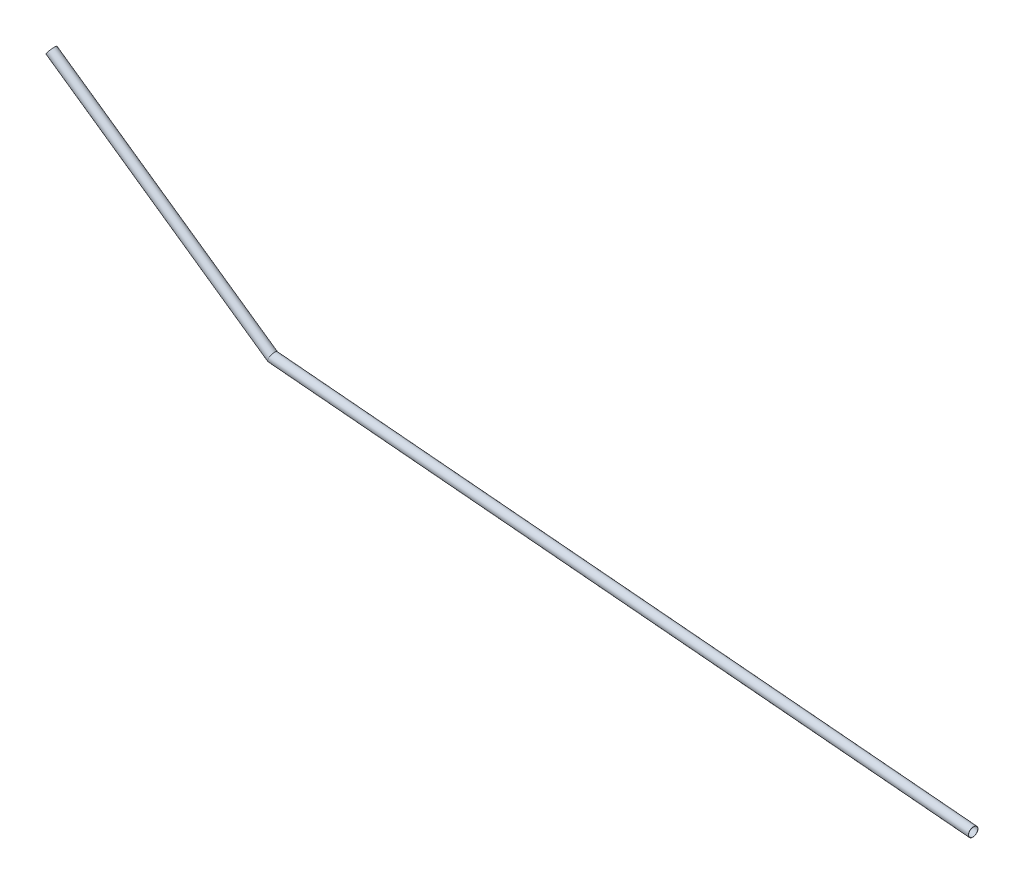
ISO-10303-21;
HEADER;
FILE_DESCRIPTION(('STEP AP214'),'2;1');
FILE_NAME('part.step','',(''),(''),'','','');
FILE_SCHEMA(('AUTOMOTIVE_DESIGN { 1 0 10303 214 1 1 1 1 }'));
ENDSEC;
DATA;
#1=APPLICATION_CONTEXT('core data for automotive mechanical design processes');
#2=APPLICATION_PROTOCOL_DEFINITION('international standard','automotive_design',2000,#1);
#3=PRODUCT_CONTEXT('',#1,'mechanical');
#4=PRODUCT('Part','Part','',(#3));
#5=PRODUCT_RELATED_PRODUCT_CATEGORY('part','',(#4));
#6=PRODUCT_DEFINITION_FORMATION('','',#4);
#7=PRODUCT_DEFINITION_CONTEXT('part definition',#1,'design');
#8=PRODUCT_DEFINITION('design','',#6,#7);
#9=PRODUCT_DEFINITION_SHAPE('','',#8);
#10=(LENGTH_UNIT() NAMED_UNIT(*) SI_UNIT(.MILLI.,.METRE.));
#11=(NAMED_UNIT(*) PLANE_ANGLE_UNIT() SI_UNIT($,.RADIAN.));
#12=(NAMED_UNIT(*) SI_UNIT($,.STERADIAN.) SOLID_ANGLE_UNIT());
#13=UNCERTAINTY_MEASURE_WITH_UNIT(LENGTH_MEASURE(1.E-05),#10,'distance_accuracy_value','');
#14=(GEOMETRIC_REPRESENTATION_CONTEXT(3) GLOBAL_UNCERTAINTY_ASSIGNED_CONTEXT((#13)) GLOBAL_UNIT_ASSIGNED_CONTEXT((#10,
#11,#12)) REPRESENTATION_CONTEXT('',''));
#15=CARTESIAN_POINT('',(0.,0.,0.));
#16=DIRECTION('',(0.,0.,1.));
#17=DIRECTION('',(1.,0.,0.));
#18=AXIS2_PLACEMENT_3D('',#15,#16,#17);
#19=CARTESIAN_POINT('',(-500.,117.270596725018,0.));
#20=DIRECTION('',(-0.819152044288987,0.573576436351053,0.));
#21=DIRECTION('',(0.573576436351053,0.819152044288987,0.));
#22=AXIS2_PLACEMENT_3D('',#19,#20,#21);
#23=PLANE('',#22);
#24=CARTESIAN_POINT('',(-500.,117.270596725018,0.));
#25=DIRECTION('',(0.819152044288987,-0.573576436351053,0.));
#26=DIRECTION('',(0.573576436351053,0.819152044288987,0.));
#27=AXIS2_PLACEMENT_3D('',#24,#25,#26);
#28=CIRCLE('',#27,2.5);
#29=CARTESIAN_POINT('',(-498.566058909122,119.31847683574,0.));
#30=VERTEX_POINT('',#29);
#31=EDGE_CURVE('E52',#30,#30,#28,.T.);
#32=ORIENTED_EDGE('',*,*,#31,.T.);
#33=EDGE_LOOP('',(#32));
#34=FACE_BOUND('',#33,.T.);
#35=CARTESIAN_POINT('',(-500.,117.270596725018,0.));
#36=DIRECTION('',(0.819152044288987,-0.573576436351053,0.));
#37=DIRECTION('',(0.573576436351053,0.819152044288987,0.));
#38=AXIS2_PLACEMENT_3D('',#35,#36,#37);
#39=CIRCLE('',#38,2.6);
#40=CARTESIAN_POINT('',(-498.508701265487,119.400392040169,0.));
#41=VERTEX_POINT('',#40);
#42=EDGE_CURVE('E50',#41,#41,#39,.T.);
#43=ORIENTED_EDGE('',*,*,#42,.F.);
#44=EDGE_LOOP('',(#43));
#45=FACE_BOUND('',#44,.T.);
#46=ADVANCED_FACE('F36',(#34,#45),#23,.T.);
#47=CARTESIAN_POINT('',(0.,0.,0.));
#48=DIRECTION('',(-0.996194698091746,0.0871557427476583,0.));
#49=DIRECTION('',(0.0871557427476583,0.996194698091746,0.));
#50=AXIS2_PLACEMENT_3D('',#47,#48,#49);
#51=PLANE('',#50);
#52=CARTESIAN_POINT('',(0.,0.,0.));
#53=DIRECTION('',(0.996194698091746,-0.0871557427476583,0.));
#54=DIRECTION('',(0.0871557427476583,0.996194698091746,0.));
#55=AXIS2_PLACEMENT_3D('',#52,#53,#54);
#56=CIRCLE('',#55,2.5);
#57=CARTESIAN_POINT('',(0.217889356869146,2.49048674522936,0.));
#58=VERTEX_POINT('',#57);
#59=EDGE_CURVE('E61',#58,#58,#56,.T.);
#60=ORIENTED_EDGE('',*,*,#59,.F.);
#61=EDGE_LOOP('',(#60));
#62=FACE_BOUND('',#61,.T.);
#63=CARTESIAN_POINT('',(0.,0.,0.));
#64=DIRECTION('',(0.996194698091746,-0.0871557427476583,0.));
#65=DIRECTION('',(0.0871557427476583,0.996194698091746,0.));
#66=AXIS2_PLACEMENT_3D('',#63,#64,#65);
#67=CIRCLE('',#66,2.6);
#68=CARTESIAN_POINT('',(0.226604931143912,2.59010621503854,0.));
#69=VERTEX_POINT('',#68);
#70=EDGE_CURVE('E40',#69,#69,#67,.T.);
#71=ORIENTED_EDGE('',*,*,#70,.T.);
#72=EDGE_LOOP('',(#71));
#73=FACE_BOUND('',#72,.T.);
#74=ADVANCED_FACE('F89',(#62,#73),#51,.F.);
#75=CARTESIAN_POINT('',(-379.314484191521,32.7656888031921,0.));
#76=DIRECTION('',(-0.819152044288987,0.573576436351053,0.));
#77=DIRECTION('',(0.573576436351053,0.819152044288987,0.));
#78=AXIS2_PLACEMENT_3D('',#75,#76,#77);
#79=CYLINDRICAL_SURFACE('',#78,2.6);
#80=CARTESIAN_POINT('',(-380.,33.2456921398512,0.));
#81=DIRECTION('',(0.939692620785907,-0.342020143325673,0.));
#82=DIRECTION('',(-0.342020143325673,-0.939692620785907,0.));
#83=AXIS2_PLACEMENT_3D('',#80,#81,#82);
#84=ELLIPSE('',#83,2.69171806906622,2.6);
#85=CARTESIAN_POINT('',(-380.920621799775,30.7163045331136,0.));
#86=VERTEX_POINT('',#85);
#87=EDGE_CURVE('E10',#86,#86,#84,.F.);
#88=ORIENTED_EDGE('',*,*,#87,.T.);
#89=EDGE_LOOP('',(#88));
#90=FACE_BOUND('',#89,.T.);
#91=ORIENTED_EDGE('',*,*,#42,.T.);
#92=EDGE_LOOP('',(#91));
#93=FACE_BOUND('',#92,.T.);
#94=ADVANCED_FACE('F85',(#90,#93),#79,.T.);
#95=CARTESIAN_POINT('',(0.,0.,0.));
#96=DIRECTION('',(-0.996194698091746,0.0871557427476583,0.));
#97=DIRECTION('',(0.0871557427476583,0.996194698091746,0.));
#98=AXIS2_PLACEMENT_3D('',#95,#96,#97);
#99=CYLINDRICAL_SURFACE('',#98,2.6);
#100=ORIENTED_EDGE('',*,*,#70,.F.);
#101=EDGE_LOOP('',(#100));
#102=FACE_BOUND('',#101,.T.);
#103=ORIENTED_EDGE('',*,*,#87,.F.);
#104=EDGE_LOOP('',(#103));
#105=FACE_BOUND('',#104,.T.);
#106=ADVANCED_FACE('F38',(#102,#105),#99,.T.);
#107=CARTESIAN_POINT('',(-379.314484191521,32.7656888031921,0.));
#108=DIRECTION('',(-0.819152044288987,0.573576436351053,0.));
#109=DIRECTION('',(0.573576436351053,0.819152044288987,0.));
#110=AXIS2_PLACEMENT_3D('',#107,#108,#109);
#111=CYLINDRICAL_SURFACE('',#110,2.5);
#112=CARTESIAN_POINT('',(-380.,33.2456921398512,0.));
#113=DIRECTION('',(0.939692620785907,-0.342020143325673,0.));
#114=DIRECTION('',(-0.342020143325673,-0.939692620785907,0.));
#115=AXIS2_PLACEMENT_3D('',#112,#113,#114);
#116=ELLIPSE('',#115,2.58819045102521,2.5);
#117=CARTESIAN_POINT('',(-380.885213269014,30.8135886718342,0.));
#118=VERTEX_POINT('',#117);
#119=EDGE_CURVE('E56',#118,#118,#116,.F.);
#120=ORIENTED_EDGE('',*,*,#119,.F.);
#121=EDGE_LOOP('',(#120));
#122=FACE_BOUND('',#121,.T.);
#123=ORIENTED_EDGE('',*,*,#31,.F.);
#124=EDGE_LOOP('',(#123));
#125=FACE_BOUND('',#124,.T.);
#126=ADVANCED_FACE('F75',(#122,#125),#111,.F.);
#127=CARTESIAN_POINT('',(0.,0.,0.));
#128=DIRECTION('',(-0.996194698091746,0.0871557427476583,0.));
#129=DIRECTION('',(0.0871557427476583,0.996194698091746,0.));
#130=AXIS2_PLACEMENT_3D('',#127,#128,#129);
#131=CYLINDRICAL_SURFACE('',#130,2.5);
#132=ORIENTED_EDGE('',*,*,#59,.T.);
#133=EDGE_LOOP('',(#132));
#134=FACE_BOUND('',#133,.T.);
#135=ORIENTED_EDGE('',*,*,#119,.T.);
#136=EDGE_LOOP('',(#135));
#137=FACE_BOUND('',#136,.T.);
#138=ADVANCED_FACE('F77',(#134,#137),#131,.F.);
#139=CLOSED_SHELL('',(#46,#74,#94,#106,#126,#138));
#140=MANIFOLD_SOLID_BREP('B2',#139);
#141=ADVANCED_BREP_SHAPE_REPRESENTATION('',(#18,#140),#14);
#142=SHAPE_DEFINITION_REPRESENTATION(#9,#141);
ENDSEC;
END-ISO-10303-21;
